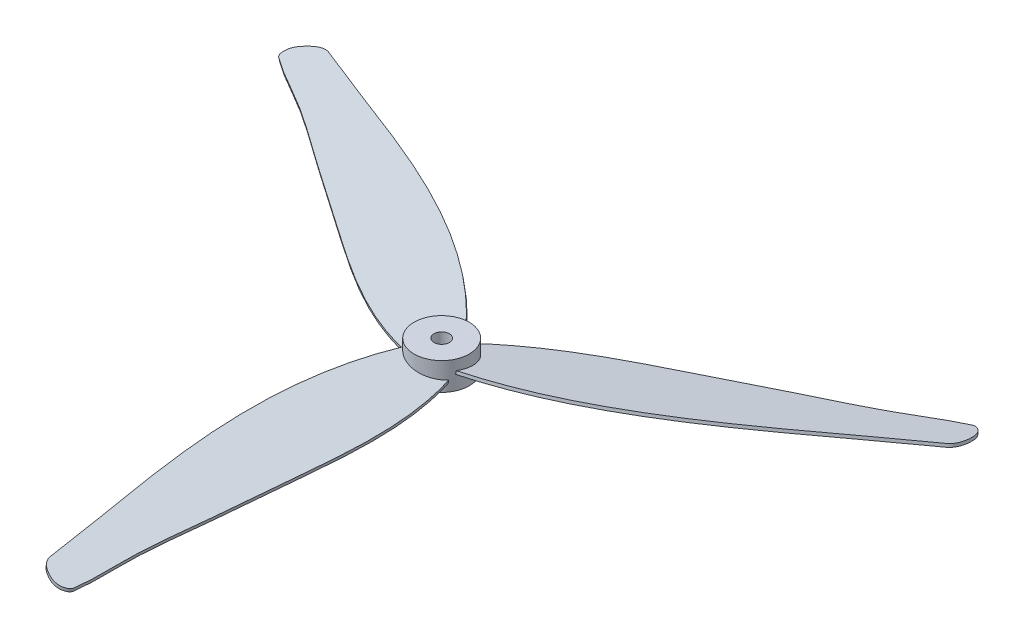
ISO-10303-21;
HEADER;
FILE_DESCRIPTION(('STEP AP214'),'2;1');
FILE_NAME('part.step','',(''),(''),'','','');
FILE_SCHEMA(('AUTOMOTIVE_DESIGN { 1 0 10303 214 1 1 1 1 }'));
ENDSEC;
DATA;
#1=APPLICATION_CONTEXT('core data for automotive mechanical design processes');
#2=APPLICATION_PROTOCOL_DEFINITION('international standard','automotive_design',2000,#1);
#3=PRODUCT_CONTEXT('',#1,'mechanical');
#4=PRODUCT('Part','Part','',(#3));
#5=PRODUCT_RELATED_PRODUCT_CATEGORY('part','',(#4));
#6=PRODUCT_DEFINITION_FORMATION('','',#4);
#7=PRODUCT_DEFINITION_CONTEXT('part definition',#1,'design');
#8=PRODUCT_DEFINITION('design','',#6,#7);
#9=PRODUCT_DEFINITION_SHAPE('','',#8);
#10=(LENGTH_UNIT() NAMED_UNIT(*) SI_UNIT(.MILLI.,.METRE.));
#11=(NAMED_UNIT(*) PLANE_ANGLE_UNIT() SI_UNIT($,.RADIAN.));
#12=(NAMED_UNIT(*) SI_UNIT($,.STERADIAN.) SOLID_ANGLE_UNIT());
#13=UNCERTAINTY_MEASURE_WITH_UNIT(LENGTH_MEASURE(1.E-05),#10,'distance_accuracy_value','');
#14=(GEOMETRIC_REPRESENTATION_CONTEXT(3) GLOBAL_UNCERTAINTY_ASSIGNED_CONTEXT((#13)) GLOBAL_UNIT_ASSIGNED_CONTEXT((#10,
#11,#12)) REPRESENTATION_CONTEXT('',''));
#15=CARTESIAN_POINT('',(0.,0.,0.));
#16=DIRECTION('',(0.,0.,1.));
#17=DIRECTION('',(1.,0.,0.));
#18=AXIS2_PLACEMENT_3D('',#15,#16,#17);
#19=CARTESIAN_POINT('',(0.,9.,0.));
#20=DIRECTION('',(0.,-1.,0.));
#21=DIRECTION('',(0.,0.,1.));
#22=AXIS2_PLACEMENT_3D('',#19,#20,#21);
#23=CYLINDRICAL_SURFACE('',#22,9.);
#24=CARTESIAN_POINT('',(0.,3.54362794025801,0.));
#25=DIRECTION('',(-0.156434465040231,-0.987688340595138,0.));
#26=DIRECTION('',(0.987688340595138,-0.156434465040231,0.));
#27=AXIS2_PLACEMENT_3D('',#24,#25,#26);
#28=ELLIPSE('',#27,9.11218613209203,9.);
#29=CARTESIAN_POINT('',(7.30430784711758,2.38673922993417,5.25804972157326));
#30=VERTEX_POINT('',#29);
#31=CARTESIAN_POINT('',(-7.28372938367546,4.69725734216683,5.2865192958489));
#32=VERTEX_POINT('',#31);
#33=EDGE_CURVE('E108',#30,#32,#28,.T.);
#34=ORIENTED_EDGE('',*,*,#33,.T.);
#35=CARTESIAN_POINT('',(-7.28372938367546,4.69725734216683,5.28651929584885));
#36=CARTESIAN_POINT('',(-7.26593509251969,4.86312914673476,5.31103307316615));
#37=CARTESIAN_POINT('',(-7.24807263926054,5.02901717759495,5.33538504089962));
#38=CARTESIAN_POINT('',(-7.2122114085355,5.36082569189989,5.38376535719889));
#39=CARTESIAN_POINT('',(-7.1942126310696,5.52674617534463,5.40779370576468));
#40=CARTESIAN_POINT('',(-7.17614569150033,5.69268288508163,5.43166024474664));
#41=B_SPLINE_CURVE_WITH_KNOTS('',3,(#35,#36,#37,#38,#39,#40),.UNSPECIFIED.,.F.,.F.,(4,2,4),(0.,
0.505844164901021,1.01168832980204),.UNSPECIFIED.);
#42=CARTESIAN_POINT('',(-7.17614569150034,5.69268288508163,5.43166024474664));
#43=VERTEX_POINT('',#42);
#44=EDGE_CURVE('E111',#32,#43,#41,.T.);
#45=ORIENTED_EDGE('',*,*,#44,.T.);
#46=CARTESIAN_POINT('',(0.,4.55609306604602,0.));
#47=DIRECTION('',(-0.156434465040231,-0.987688340595138,0.));
#48=DIRECTION('',(0.987688340595138,-0.156434465040231,0.));
#49=AXIS2_PLACEMENT_3D('',#46,#47,#48);
#50=ELLIPSE('',#49,9.11218613209203,9.);
#51=CARTESIAN_POINT('',(7.41620379576395,3.38148177852124,5.09901179246494));
#52=VERTEX_POINT('',#51);
#53=EDGE_CURVE('E182',#52,#43,#50,.T.);
#54=ORIENTED_EDGE('',*,*,#53,.F.);
#55=CARTESIAN_POINT('',(7.41620379576395,3.38148177852124,5.09901179246494));
#56=CARTESIAN_POINT('',(7.39770465756707,3.21573761419823,5.12591312980971));
#57=CARTESIAN_POINT('',(7.37913042608144,3.04997031965447,5.15261695924113));
#58=CARTESIAN_POINT('',(7.34183177653266,2.71838947012545,5.20562960227724));
#59=CARTESIAN_POINT('',(7.3231073584695,2.55257591514019,5.23193841588193));
#60=CARTESIAN_POINT('',(7.30430784711759,2.38673922993417,5.25804972157327));
#61=B_SPLINE_CURVE_WITH_KNOTS('',3,(#55,#56,#57,#58,#59,#60),.UNSPECIFIED.,.F.,.F.,(4,2,4),(0.,
0.506785983130427,1.01357196626085),.UNSPECIFIED.);
#62=EDGE_CURVE('E168',#52,#30,#61,.T.);
#63=ORIENTED_EDGE('',*,*,#62,.T.);
#64=EDGE_LOOP('',(#34,#45,#54,#63));
#65=FACE_BOUND('',#64,.T.);
#66=CARTESIAN_POINT('',(0.,0.,0.));
#67=DIRECTION('',(0.,-1.,0.));
#68=DIRECTION('',(0.,0.,-1.));
#69=AXIS2_PLACEMENT_3D('',#66,#67,#68);
#70=CIRCLE('',#69,9.);
#71=CARTESIAN_POINT('',(0.,0.,-9.));
#72=VERTEX_POINT('',#71);
#73=EDGE_CURVE('E229',#72,#72,#70,.T.);
#74=ORIENTED_EDGE('',*,*,#73,.F.);
#75=EDGE_LOOP('',(#74));
#76=FACE_BOUND('',#75,.T.);
#77=CARTESIAN_POINT('',(0.,9.,0.));
#78=DIRECTION('',(0.,-1.,0.));
#79=DIRECTION('',(0.,0.,-1.));
#80=AXIS2_PLACEMENT_3D('',#77,#78,#79);
#81=CIRCLE('',#80,9.);
#82=CARTESIAN_POINT('',(0.,9.,-9.));
#83=VERTEX_POINT('',#82);
#84=EDGE_CURVE('E232',#83,#83,#81,.T.);
#85=ORIENTED_EDGE('',*,*,#84,.T.);
#86=EDGE_LOOP('',(#85));
#87=FACE_BOUND('',#86,.T.);
#88=CARTESIAN_POINT('',(0.,3.54362794025801,0.));
#89=DIRECTION('',(0.0782172325201163,-0.987688340595138,0.135476220752269));
#90=DIRECTION('',(-0.493844170297573,-0.156434465040231,-0.855363193977084));
#91=AXIS2_PLACEMENT_3D('',#88,#89,#90);
#92=ELLIPSE('',#91,9.11218613209203,9.);
#93=CARTESIAN_POINT('',(0.901450709685308,2.38673922993417,-8.95474101345248));
#94=VERTEX_POINT('',#93);
#95=CARTESIAN_POINT('',(8.22012469963952,4.69725734216683,3.66463503262963));
#96=VERTEX_POINT('',#95);
#97=EDGE_CURVE('E184',#94,#96,#92,.T.);
#98=ORIENTED_EDGE('',*,*,#97,.T.);
#99=CARTESIAN_POINT('',(8.22012469963947,4.69725734216683,3.66463503262966));
#100=CARTESIAN_POINT('',(8.23245710796109,4.86312914673476,3.63696783578777));
#101=CARTESIAN_POINT('',(8.24461530402083,5.02901717759496,3.6093225136247));
#102=CARTESIAN_POINT('',(8.2685832716166,5.36082569189989,3.55407561865621));
#103=CARTESIAN_POINT('',(8.28039304315262,5.52674617534463,3.52647404585078));
#104=CARTESIAN_POINT('',(8.29202860242678,5.69268288508163,3.49889434772418));
#105=B_SPLINE_CURVE_WITH_KNOTS('',3,(#99,#100,#101,#102,#103,#104),.UNSPECIFIED.,.F.,.F.,(4,2,
4),(0.,0.505844164901022,1.01168832980204),.UNSPECIFIED.);
#106=CARTESIAN_POINT('',(8.29202860242678,5.69268288508163,3.49889434772418));
#107=VERTEX_POINT('',#106);
#108=EDGE_CURVE('E187',#96,#107,#105,.T.);
#109=ORIENTED_EDGE('',*,*,#108,.T.);
#110=CARTESIAN_POINT('',(0.,4.55609306604602,0.));
#111=DIRECTION('',(0.0782172325201163,-0.987688340595138,0.135476220752269));
#112=DIRECTION('',(-0.493844170297573,-0.156434465040231,-0.855363193977084));
#113=AXIS2_PLACEMENT_3D('',#110,#111,#112);
#114=ELLIPSE('',#113,9.11218613209203,9.);
#115=CARTESIAN_POINT('',(0.707771848589048,3.38148177852124,-8.97212678300663));
#116=VERTEX_POINT('',#115);
#117=EDGE_CURVE('E235',#116,#107,#114,.T.);
#118=ORIENTED_EDGE('',*,*,#117,.F.);
#119=CARTESIAN_POINT('',(0.707771848589028,3.38148177852124,-8.97212678300662));
#120=CARTESIAN_POINT('',(0.740318659223825,3.21573761419823,-8.9695567280524));
#121=CARTESIAN_POINT('',(0.77273196963258,3.04997031965448,-8.96682288644578));
#122=CARTESIAN_POINT('',(0.837291589998006,2.71838947012545,-8.96102762992774));
#123=CARTESIAN_POINT('',(0.869437899954678,2.55257591514019,-8.95796621501631));
#124=CARTESIAN_POINT('',(0.901450709685308,2.38673922993417,-8.95474101345248));
#125=B_SPLINE_CURVE_WITH_KNOTS('',3,(#119,#120,#121,#122,#123,#124),.UNSPECIFIED.,.F.,.F.,(4,2,
4),(0.,0.506785983130426,1.01357196626085),.UNSPECIFIED.);
#126=EDGE_CURVE('E197',#116,#94,#125,.T.);
#127=ORIENTED_EDGE('',*,*,#126,.T.);
#128=EDGE_LOOP('',(#98,#109,#118,#127));
#129=FACE_BOUND('',#128,.T.);
#130=CARTESIAN_POINT('',(0.,3.54362794025801,0.));
#131=DIRECTION('',(0.0782172325201162,-0.987688340595138,-0.135476220752269));
#132=DIRECTION('',(-0.493844170297573,-0.156434465040231,0.855363193977084));
#133=AXIS2_PLACEMENT_3D('',#130,#131,#132);
#134=ELLIPSE('',#133,9.11218613209203,9.);
#135=CARTESIAN_POINT('',(-8.20575855680295,2.38673922993417,3.69669129187918));
#136=VERTEX_POINT('',#135);
#137=CARTESIAN_POINT('',(-0.936395315964,4.69725734216683,-8.95115432847857));
#138=VERTEX_POINT('',#137);
#139=EDGE_CURVE('E11',#136,#138,#134,.T.);
#140=ORIENTED_EDGE('',*,*,#139,.T.);
#141=CARTESIAN_POINT('',(-0.936395315963954,4.69725734216683,-8.95115432847855));
#142=CARTESIAN_POINT('',(-0.966522015441339,4.86312914673476,-8.94800090895396));
#143=CARTESIAN_POINT('',(-0.996542664760233,5.02901717759495,-8.94470755452437));
#144=CARTESIAN_POINT('',(-1.05637186308104,5.36082569189988,-8.93784097585514));
#145=CARTESIAN_POINT('',(-1.08618041208296,5.52674617534462,-8.93426775161551));
#146=CARTESIAN_POINT('',(-1.11588291092638,5.69268288508162,-8.93055459247086));
#147=B_SPLINE_CURVE_WITH_KNOTS('',3,(#141,#142,#143,#144,#145,#146),.UNSPECIFIED.,.F.,.F.,(4,2,
4),(0.,0.505844164901016,1.01168832980203),.UNSPECIFIED.);
#148=CARTESIAN_POINT('',(-1.11588291092639,5.69268288508163,-8.93055459247086));
#149=VERTEX_POINT('',#148);
#150=EDGE_CURVE('E51',#138,#149,#147,.T.);
#151=ORIENTED_EDGE('',*,*,#150,.T.);
#152=CARTESIAN_POINT('',(0.,4.55609306604602,0.));
#153=DIRECTION('',(0.0782172325201162,-0.987688340595138,-0.135476220752269));
#154=DIRECTION('',(-0.493844170297573,-0.156434465040231,0.855363193977084));
#155=AXIS2_PLACEMENT_3D('',#152,#153,#154);
#156=ELLIPSE('',#155,9.11218613209203,9.);
#157=CARTESIAN_POINT('',(-8.12397564435306,3.38148177852124,3.87311499054165));
#158=VERTEX_POINT('',#157);
#159=EDGE_CURVE('E98',#158,#149,#156,.T.);
#160=ORIENTED_EDGE('',*,*,#159,.F.);
#161=CARTESIAN_POINT('',(-8.12397564435305,3.38148177852123,3.87311499054165));
#162=CARTESIAN_POINT('',(-8.13802331679097,3.21573761419823,3.84364359824265));
#163=CARTESIAN_POINT('',(-8.15186239571408,3.04997031965447,3.81420592720461));
#164=CARTESIAN_POINT('',(-8.17912336653072,2.71838947012545,3.75539802765046));
#165=CARTESIAN_POINT('',(-8.19254525842424,2.55257591514019,3.72602779913434));
#166=CARTESIAN_POINT('',(-8.20575855680295,2.38673922993418,3.69669129187918));
#167=B_SPLINE_CURVE_WITH_KNOTS('',3,(#161,#162,#163,#164,#165,#166),.UNSPECIFIED.,.F.,.F.,(4,2,
4),(0.,0.50678598313042,1.01357196626084),.UNSPECIFIED.);
#168=EDGE_CURVE('E103',#158,#136,#167,.T.);
#169=ORIENTED_EDGE('',*,*,#168,.T.);
#170=EDGE_LOOP('',(#140,#151,#160,#169));
#171=FACE_BOUND('',#170,.T.);
#172=ADVANCED_FACE('F43',(#65,#76,#87,#129,#171),#23,.T.);
#173=CARTESIAN_POINT('',(0.,9.,0.));
#174=DIRECTION('',(0.,1.,0.));
#175=DIRECTION('',(0.,0.,-1.));
#176=AXIS2_PLACEMENT_3D('',#173,#174,#175);
#177=PLANE('',#176);
#178=ORIENTED_EDGE('',*,*,#84,.F.);
#179=EDGE_LOOP('',(#178));
#180=FACE_BOUND('',#179,.T.);
#181=CARTESIAN_POINT('',(0.,9.,0.));
#182=DIRECTION('',(0.,-1.,0.));
#183=DIRECTION('',(0.,0.,-1.));
#184=AXIS2_PLACEMENT_3D('',#181,#182,#183);
#185=CIRCLE('',#184,2.5);
#186=CARTESIAN_POINT('',(0.,9.,-2.5));
#187=VERTEX_POINT('',#186);
#188=EDGE_CURVE('E223',#187,#187,#185,.T.);
#189=ORIENTED_EDGE('',*,*,#188,.T.);
#190=EDGE_LOOP('',(#189));
#191=FACE_BOUND('',#190,.T.);
#192=ADVANCED_FACE('F251',(#180,#191),#177,.T.);
#193=CARTESIAN_POINT('',(0.,0.,0.));
#194=DIRECTION('',(0.,1.,0.));
#195=DIRECTION('',(0.,0.,-1.));
#196=AXIS2_PLACEMENT_3D('',#193,#194,#195);
#197=PLANE('',#196);
#198=ORIENTED_EDGE('',*,*,#73,.T.);
#199=EDGE_LOOP('',(#198));
#200=FACE_BOUND('',#199,.T.);
#201=CARTESIAN_POINT('',(0.,0.,0.));
#202=DIRECTION('',(0.,-1.,0.));
#203=DIRECTION('',(0.,0.,-1.));
#204=AXIS2_PLACEMENT_3D('',#201,#202,#203);
#205=CIRCLE('',#204,2.5);
#206=CARTESIAN_POINT('',(0.,0.,-2.5));
#207=VERTEX_POINT('',#206);
#208=EDGE_CURVE('E216',#207,#207,#205,.T.);
#209=ORIENTED_EDGE('',*,*,#208,.F.);
#210=EDGE_LOOP('',(#209));
#211=FACE_BOUND('',#210,.T.);
#212=ADVANCED_FACE('F255',(#200,#211),#197,.F.);
#213=CARTESIAN_POINT('',(0.,9.,0.));
#214=DIRECTION('',(0.,-1.,0.));
#215=DIRECTION('',(0.,0.,1.));
#216=AXIS2_PLACEMENT_3D('',#213,#214,#215);
#217=CYLINDRICAL_SURFACE('',#216,2.5);
#218=ORIENTED_EDGE('',*,*,#188,.F.);
#219=EDGE_LOOP('',(#218));
#220=FACE_BOUND('',#219,.T.);
#221=ORIENTED_EDGE('',*,*,#208,.T.);
#222=EDGE_LOOP('',(#221));
#223=FACE_BOUND('',#222,.T.);
#224=ADVANCED_FACE('F207',(#220,#223),#217,.F.);
#225=CARTESIAN_POINT('',(6.07128886437522,4.58317983054747,4.07358476355836));
#226=CARTESIAN_POINT('',(30.0274191154173,5.88967505732956,-0.232500129810801));
#227=CARTESIAN_POINT('',(65.3611569346111,5.90057996757105,-20.5529410073428));
#228=CARTESIAN_POINT('',(95.6678257611402,4.77268380270435,-46.2734226874995));
#229=CARTESIAN_POINT('',(110.338679272948,4.43565398162164,-57.2007572182211));
#230=CARTESIAN_POINT('',(110.888971991819,3.8453898245611,-61.8217851437842));
#231=CARTESIAN_POINT('',(109.606010039389,3.14844611510895,-66.1621294437965));
#232=CARTESIAN_POINT('',(106.812806514418,2.73477342422366,-67.5653501932813));
#233=CARTESIAN_POINT('',(105.316603334889,2.7101153798658,-66.8812861666804));
#234=CARTESIAN_POINT('',(99.7791919174203,2.61715864183006,-64.3619605745815));
#235=CARTESIAN_POINT('',(88.5197573784138,2.72077298483617,-57.1059234454856));
#236=CARTESIAN_POINT('',(70.2021946473294,2.3700309638207,-49.0873556658917));
#237=CARTESIAN_POINT('',(39.3058016566439,2.0131199885944,-33.8513715628341));
#238=CARTESIAN_POINT('',(14.3923305409287,1.52115674879017,-23.0542265062131));
#239=CARTESIAN_POINT('',(0.244924495635226,2.42772974256338,-8.27685441144336));
#240=B_SPLINE_CURVE_WITH_KNOTS('',3,(#225,#226,#227,#228,#229,#230,#231,#232,#233,#234,#235,
#236,#237,#238,#239),.UNSPECIFIED.,.F.,.F.,(4,1,1,1,1,1,1,1,1,1,1,1,4),(0.,0.28293344669307,
0.466482550178483,0.471857061893158,0.495005991949986,0.514382548074224,0.523354602147642,
0.526650828201052,0.53318720122455,0.595375397845292,0.68247325334402,0.76793576336452,1.),.UNSPECIFIED.);
#241=DIRECTION('',(-0.0782172325201162,0.987688340595138,-0.135476220752268));
#242=VECTOR('',#241,1.);
#243=SURFACE_OF_LINEAR_EXTRUSION('',#240,#242);
#244=EDGE_CURVE('E211',#96,#94,#240,.T.);
#245=ORIENTED_EDGE('',*,*,#244,.T.);
#246=ORIENTED_EDGE('',*,*,#126,.F.);
#247=CARTESIAN_POINT('',(5.9930716318551,5.57086817114261,3.93810854280609));
#248=CARTESIAN_POINT('',(29.9492018828972,6.8773633979247,-0.367976350563069));
#249=CARTESIAN_POINT('',(65.2829397020909,6.88826830816618,-20.6884172280951));
#250=CARTESIAN_POINT('',(95.58960852862,5.76037214329949,-46.4088989082518));
#251=CARTESIAN_POINT('',(110.260462040428,5.42334232221677,-57.3362334389734));
#252=CARTESIAN_POINT('',(110.810754759299,4.83307816515624,-61.9572613645364));
#253=CARTESIAN_POINT('',(109.527792806869,4.13613445570409,-66.2976056645488));
#254=CARTESIAN_POINT('',(106.734589281898,3.7224617648188,-67.7008264140335));
#255=CARTESIAN_POINT('',(105.238386102369,3.69780372046094,-67.0167623874327));
#256=CARTESIAN_POINT('',(99.7009746849001,3.6048469824252,-64.4974367953338));
#257=CARTESIAN_POINT('',(88.4415401458937,3.70846132543131,-57.2413996662378));
#258=CARTESIAN_POINT('',(70.1239774148093,3.35771930441584,-49.222831886644));
#259=CARTESIAN_POINT('',(39.2275844241237,3.00080832918954,-33.9868477835864));
#260=CARTESIAN_POINT('',(14.3141133084086,2.50884508938531,-23.1897027269654));
#261=CARTESIAN_POINT('',(0.16670726311511,3.41541808315852,-8.41233063219563));
#262=B_SPLINE_CURVE_WITH_KNOTS('',3,(#247,#248,#249,#250,#251,#252,#253,#254,#255,#256,#257,
#258,#259,#260,#261),.UNSPECIFIED.,.F.,.F.,(4,1,1,1,1,1,1,1,1,1,1,1,4),(0.,0.28293344669307,
0.466482550178483,0.471857061893158,0.495005991949986,0.514382548074224,0.523354602147642,
0.526650828201052,0.53318720122455,0.595375397845292,0.68247325334402,0.76793576336452,1.),.UNSPECIFIED.);
#263=EDGE_CURVE('E151',#107,#116,#262,.T.);
#264=ORIENTED_EDGE('',*,*,#263,.F.);
#265=ORIENTED_EDGE('',*,*,#108,.F.);
#266=EDGE_LOOP('',(#245,#246,#264,#265));
#267=FACE_BOUND('',#266,.T.);
#268=ADVANCED_FACE('F203',(#267),#243,.T.);
#269=CARTESIAN_POINT('',(110.275945295483,3.5873097675363,-63.3493846772373));
#270=DIRECTION('',(-0.0782172325201163,0.987688340595138,-0.135476220752269));
#271=DIRECTION('',(0.,-0.135892549420804,-0.9907235815362));
#272=AXIS2_PLACEMENT_3D('',#269,#270,#271);
#273=PLANE('',#272);
#274=ORIENTED_EDGE('',*,*,#244,.F.);
#275=ORIENTED_EDGE('',*,*,#97,.F.);
#276=EDGE_LOOP('',(#274,#275));
#277=FACE_BOUND('',#276,.T.);
#278=ADVANCED_FACE('F164',(#277),#273,.F.);
#279=CARTESIAN_POINT('',(110.197728062963,4.57499810813144,-63.4848608979895));
#280=DIRECTION('',(-0.0782172325201163,0.987688340595138,-0.135476220752269));
#281=DIRECTION('',(0.,-0.135892549420804,-0.9907235815362));
#282=AXIS2_PLACEMENT_3D('',#279,#280,#281);
#283=PLANE('',#282);
#284=ORIENTED_EDGE('',*,*,#117,.T.);
#285=ORIENTED_EDGE('',*,*,#263,.T.);
#286=EDGE_LOOP('',(#284,#285));
#287=FACE_BOUND('',#286,.T.);
#288=ADVANCED_FACE('F163',(#287),#283,.T.);
#289=CARTESIAN_POINT('',(-6.56347232189839,4.58317983054747,3.22109800848331));
#290=CARTESIAN_POINT('',(-14.8123585389095,5.88967505732956,26.1207578289392));
#291=CARTESIAN_POINT('',(-14.8812094324641,5.90057996757105,66.8808928297859));
#292=CARTESIAN_POINT('',(-7.75995331314078,4.77268380270435,105.98747877772));
#293=CARTESIAN_POINT('',(-5.63203076978911,4.43565398162164,124.156477879507));
#294=CARTESIAN_POINT('',(-1.90524955408981,3.8453898245611,126.943559316349));
#295=CARTESIAN_POINT('',(2.49507984710695,3.14844611510895,128.002653823462));
#296=CARTESIAN_POINT('',(5.10690642576363,2.73477342422366,126.285278987639));
#297=CARTESIAN_POINT('',(5.26259119067698,2.7101153798658,124.647497011643));
#298=CARTESIAN_POINT('',(5.84949693624938,2.61715864183006,118.59229525686));
#299=CARTESIAN_POINT('',(5.1953017211525,2.72077298483617,105.213320349284));
#300=CARTESIAN_POINT('',(7.4097996875991,2.3700309638207,85.3405617989531));
#301=CARTESIAN_POINT('',(9.66324689803829,2.0131199885944,50.9655085321832));
#302=CARTESIAN_POINT('',(12.7693805485167,1.52115674879017,23.9912371212135));
#303=CARTESIAN_POINT('',(7.04550393591762,2.42772974256338,4.35053804095091));
#304=B_SPLINE_CURVE_WITH_KNOTS('',3,(#289,#290,#291,#292,#293,#294,#295,#296,#297,#298,#299,
#300,#301,#302,#303),.UNSPECIFIED.,.F.,.F.,(4,1,1,1,1,1,1,1,1,1,1,1,4),(0.,0.28293344669307,
0.466482550178483,0.471857061893158,0.495005991949986,0.514382548074224,0.523354602147642,
0.526650828201052,0.53318720122455,0.595375397845292,0.68247325334402,0.76793576336452,1.),.UNSPECIFIED.);
#305=DIRECTION('',(0.156434465040231,0.987688340595138,0.));
#306=VECTOR('',#305,1.);
#307=SURFACE_OF_LINEAR_EXTRUSION('',#304,#306);
#308=EDGE_CURVE('E143',#32,#30,#304,.T.);
#309=ORIENTED_EDGE('',*,*,#308,.T.);
#310=ORIENTED_EDGE('',*,*,#62,.F.);
#311=CARTESIAN_POINT('',(-6.40703785685816,5.57086817114261,3.22109800848331));
#312=CARTESIAN_POINT('',(-14.6559240738692,6.8773633979247,26.1207578289392));
#313=CARTESIAN_POINT('',(-14.7247749674238,6.88826830816618,66.8808928297859));
#314=CARTESIAN_POINT('',(-7.60351884810055,5.76037214329949,105.98747877772));
#315=CARTESIAN_POINT('',(-5.47559630474888,5.42334232221677,124.156477879507));
#316=CARTESIAN_POINT('',(-1.74881508904958,4.83307816515624,126.943559316349));
#317=CARTESIAN_POINT('',(2.65151431214718,4.13613445570409,128.002653823462));
#318=CARTESIAN_POINT('',(5.26334089080386,3.7224617648188,126.285278987639));
#319=CARTESIAN_POINT('',(5.41902565571722,3.69780372046094,124.647497011643));
#320=CARTESIAN_POINT('',(6.00593140128962,3.6048469824252,118.59229525686));
#321=CARTESIAN_POINT('',(5.35173618619274,3.70846132543131,105.213320349284));
#322=CARTESIAN_POINT('',(7.56623415263933,3.35771930441584,85.3405617989531));
#323=CARTESIAN_POINT('',(9.81968136307852,3.00080832918954,50.9655085321832));
#324=CARTESIAN_POINT('',(12.9258150135569,2.50884508938531,23.9912371212135));
#325=CARTESIAN_POINT('',(7.20193840095785,3.41541808315852,4.35053804095091));
#326=B_SPLINE_CURVE_WITH_KNOTS('',3,(#311,#312,#313,#314,#315,#316,#317,#318,#319,#320,#321,
#322,#323,#324,#325),.UNSPECIFIED.,.F.,.F.,(4,1,1,1,1,1,1,1,1,1,1,1,4),(0.,0.28293344669307,
0.466482550178483,0.471857061893158,0.495005991949986,0.514382548074224,0.523354602147642,
0.526650828201052,0.53318720122455,0.595375397845292,0.68247325334402,0.76793576336452,1.),.UNSPECIFIED.);
#327=EDGE_CURVE('E66',#43,#52,#326,.T.);
#328=ORIENTED_EDGE('',*,*,#327,.F.);
#329=ORIENTED_EDGE('',*,*,#44,.F.);
#330=EDGE_LOOP('',(#309,#310,#328,#329));
#331=FACE_BOUND('',#330,.T.);
#332=ADVANCED_FACE('F159',(#331),#307,.T.);
#333=CARTESIAN_POINT('',(-0.275796203142048,3.5873097675363,127.17646239085));
#334=DIRECTION('',(0.156434465040231,0.987688340595138,0.));
#335=DIRECTION('',(0.85799178973865,-0.135892549420804,0.495361790768104));
#336=AXIS2_PLACEMENT_3D('',#333,#334,#335);
#337=PLANE('',#336);
#338=ORIENTED_EDGE('',*,*,#308,.F.);
#339=ORIENTED_EDGE('',*,*,#33,.F.);
#340=EDGE_LOOP('',(#338,#339));
#341=FACE_BOUND('',#340,.T.);
#342=ADVANCED_FACE('F131',(#341),#337,.F.);
#343=CARTESIAN_POINT('',(-0.119361738101816,4.57499810813144,127.17646239085));
#344=DIRECTION('',(0.156434465040231,0.987688340595138,0.));
#345=DIRECTION('',(0.85799178973865,-0.135892549420804,0.495361790768104));
#346=AXIS2_PLACEMENT_3D('',#343,#344,#345);
#347=PLANE('',#346);
#348=ORIENTED_EDGE('',*,*,#53,.T.);
#349=ORIENTED_EDGE('',*,*,#327,.T.);
#350=EDGE_LOOP('',(#348,#349));
#351=FACE_BOUND('',#350,.T.);
#352=ADVANCED_FACE('F129',(#351),#347,.T.);
#353=CARTESIAN_POINT('',(0.492183457523219,4.58317983054747,-7.29468277204169));
#354=CARTESIAN_POINT('',(-15.2150605765078,5.88967505732956,-25.8882576991286));
#355=CARTESIAN_POINT('',(-50.4799475021469,5.90057996757105,-46.3279518224437));
#356=CARTESIAN_POINT('',(-87.9078724479993,4.77268380270435,-59.7140560902217));
#357=CARTESIAN_POINT('',(-104.706648503159,4.43565398162164,-66.9557206612871));
#358=CARTESIAN_POINT('',(-108.98372243773,3.8453898245611,-65.1217741725657));
#359=CARTESIAN_POINT('',(-112.101089886496,3.14844611510895,-61.8405243796661));
#360=CARTESIAN_POINT('',(-111.919712940182,2.73477342422366,-58.7199287943587));
#361=CARTESIAN_POINT('',(-110.579194525566,2.7101153798658,-57.7662108449635));
#362=CARTESIAN_POINT('',(-105.62868885367,2.61715864183006,-54.2303346822791));
#363=CARTESIAN_POINT('',(-93.7150590995663,2.72077298483617,-48.1073969037994));
#364=CARTESIAN_POINT('',(-77.6119943349286,2.3700309638207,-36.2532061330621));
#365=CARTESIAN_POINT('',(-48.9690485546822,2.0131199885944,-17.1141369693495));
#366=CARTESIAN_POINT('',(-27.1617110894455,1.52115674879017,-0.93701061500056));
#367=CARTESIAN_POINT('',(-7.2904284315529,2.42772974256338,3.92631637049242));
#368=B_SPLINE_CURVE_WITH_KNOTS('',3,(#353,#354,#355,#356,#357,#358,#359,#360,#361,#362,#363,
#364,#365,#366,#367),.UNSPECIFIED.,.F.,.F.,(4,1,1,1,1,1,1,1,1,1,1,1,4),(0.,0.28293344669307,
0.466482550178483,0.471857061893158,0.495005991949986,0.514382548074224,0.523354602147642,
0.526650828201052,0.53318720122455,0.595375397845292,0.68247325334402,0.76793576336452,1.),.UNSPECIFIED.);
#369=DIRECTION('',(-0.0782172325201162,0.987688340595138,0.135476220752268));
#370=VECTOR('',#369,1.);
#371=SURFACE_OF_LINEAR_EXTRUSION('',#368,#370);
#372=EDGE_CURVE('E100',#138,#136,#368,.T.);
#373=ORIENTED_EDGE('',*,*,#372,.T.);
#374=ORIENTED_EDGE('',*,*,#168,.F.);
#375=CARTESIAN_POINT('',(0.413966225003103,5.57086817114261,-7.15920655128942));
#376=CARTESIAN_POINT('',(-15.2932778090279,6.8773633979247,-25.7527814783764));
#377=CARTESIAN_POINT('',(-50.558164734667,6.88826830816618,-46.1924756016914));
#378=CARTESIAN_POINT('',(-87.9860896805194,5.76037214329949,-59.5785798694695));
#379=CARTESIAN_POINT('',(-104.784865735679,5.42334232221677,-66.8202444405348));
#380=CARTESIAN_POINT('',(-109.06193967025,4.83307816515624,-64.9862979518134));
#381=CARTESIAN_POINT('',(-112.179307119016,4.13613445570409,-61.7050481589139));
#382=CARTESIAN_POINT('',(-111.997930172702,3.7224617648188,-58.5844525736064));
#383=CARTESIAN_POINT('',(-110.657411758086,3.69780372046094,-57.6307346242112));
#384=CARTESIAN_POINT('',(-105.70690608619,3.6048469824252,-54.0948584615268));
#385=CARTESIAN_POINT('',(-93.7932763320864,3.70846132543131,-47.9719206830471));
#386=CARTESIAN_POINT('',(-77.6902115674487,3.35771930441584,-36.1177299123098));
#387=CARTESIAN_POINT('',(-49.0472657872023,3.00080832918954,-16.9786607485972));
#388=CARTESIAN_POINT('',(-27.2399283219656,2.50884508938531,-0.801534394248291));
#389=CARTESIAN_POINT('',(-7.36864566407302,3.41541808315852,4.06179259124468));
#390=B_SPLINE_CURVE_WITH_KNOTS('',3,(#375,#376,#377,#378,#379,#380,#381,#382,#383,#384,#385,
#386,#387,#388,#389),.UNSPECIFIED.,.F.,.F.,(4,1,1,1,1,1,1,1,1,1,1,1,4),(0.,0.28293344669307,
0.466482550178483,0.471857061893158,0.495005991949986,0.514382548074224,0.523354602147642,
0.526650828201052,0.53318720122455,0.595375397845292,0.68247325334402,0.76793576336452,1.),.UNSPECIFIED.);
#391=EDGE_CURVE('E58',#149,#158,#390,.T.);
#392=ORIENTED_EDGE('',*,*,#391,.F.);
#393=ORIENTED_EDGE('',*,*,#150,.F.);
#394=EDGE_LOOP('',(#373,#374,#392,#393));
#395=FACE_BOUND('',#394,.T.);
#396=ADVANCED_FACE('F104',(#395),#371,.T.);
#397=CARTESIAN_POINT('',(-110.000149092341,3.5873097675363,-63.8270777136139));
#398=DIRECTION('',(-0.0782172325201162,0.987688340595138,0.135476220752269));
#399=DIRECTION('',(-0.857991789738657,-0.135892549420804,0.495361790768092));
#400=AXIS2_PLACEMENT_3D('',#397,#398,#399);
#401=PLANE('',#400);
#402=ORIENTED_EDGE('',*,*,#372,.F.);
#403=ORIENTED_EDGE('',*,*,#139,.F.);
#404=EDGE_LOOP('',(#402,#403));
#405=FACE_BOUND('',#404,.T.);
#406=ADVANCED_FACE('F128',(#405),#401,.F.);
#407=CARTESIAN_POINT('',(-110.078366324861,4.57499810813144,-63.6916014928616));
#408=DIRECTION('',(-0.0782172325201162,0.987688340595138,0.135476220752269));
#409=DIRECTION('',(-0.857991789738657,-0.135892549420804,0.495361790768092));
#410=AXIS2_PLACEMENT_3D('',#407,#408,#409);
#411=PLANE('',#410);
#412=ORIENTED_EDGE('',*,*,#159,.T.);
#413=ORIENTED_EDGE('',*,*,#391,.T.);
#414=EDGE_LOOP('',(#412,#413));
#415=FACE_BOUND('',#414,.T.);
#416=ADVANCED_FACE('F96',(#415),#411,.T.);
#417=CLOSED_SHELL('',(#172,#192,#212,#224,#268,#278,#288,#332,#342,#352,#396,#406,#416));
#418=MANIFOLD_SOLID_BREP('B2',#417);
#419=ADVANCED_BREP_SHAPE_REPRESENTATION('',(#18,#418),#14);
#420=SHAPE_DEFINITION_REPRESENTATION(#9,#419);
ENDSEC;
END-ISO-10303-21;
